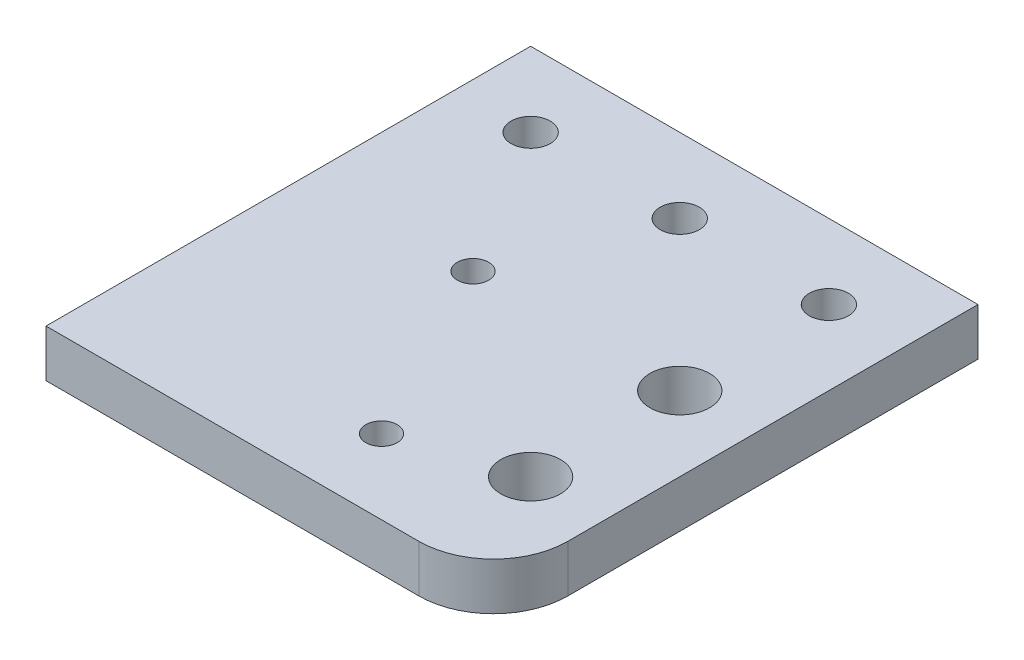
ISO-10303-21;
HEADER;
FILE_DESCRIPTION(('STEP AP214'),'2;1');
FILE_NAME('part.step','',(''),(''),'','','');
FILE_SCHEMA(('AUTOMOTIVE_DESIGN { 1 0 10303 214 1 1 1 1 }'));
ENDSEC;
DATA;
#1=APPLICATION_CONTEXT('core data for automotive mechanical design processes');
#2=APPLICATION_PROTOCOL_DEFINITION('international standard','automotive_design',2000,#1);
#3=PRODUCT_CONTEXT('',#1,'mechanical');
#4=PRODUCT('Part','Part','',(#3));
#5=PRODUCT_RELATED_PRODUCT_CATEGORY('part','',(#4));
#6=PRODUCT_DEFINITION_FORMATION('','',#4);
#7=PRODUCT_DEFINITION_CONTEXT('part definition',#1,'design');
#8=PRODUCT_DEFINITION('design','',#6,#7);
#9=PRODUCT_DEFINITION_SHAPE('','',#8);
#10=(LENGTH_UNIT() NAMED_UNIT(*) SI_UNIT(.MILLI.,.METRE.));
#11=(NAMED_UNIT(*) PLANE_ANGLE_UNIT() SI_UNIT($,.RADIAN.));
#12=(NAMED_UNIT(*) SI_UNIT($,.STERADIAN.) SOLID_ANGLE_UNIT());
#13=UNCERTAINTY_MEASURE_WITH_UNIT(LENGTH_MEASURE(1.E-05),#10,'distance_accuracy_value','');
#14=(GEOMETRIC_REPRESENTATION_CONTEXT(3) GLOBAL_UNCERTAINTY_ASSIGNED_CONTEXT((#13)) GLOBAL_UNIT_ASSIGNED_CONTEXT((#10,
#11,#12)) REPRESENTATION_CONTEXT('',''));
#15=CARTESIAN_POINT('',(0.,0.,0.));
#16=DIRECTION('',(0.,0.,1.));
#17=DIRECTION('',(1.,0.,0.));
#18=AXIS2_PLACEMENT_3D('',#15,#16,#17);
#19=CARTESIAN_POINT('',(0.,6.35,0.));
#20=DIRECTION('',(0.,1.,0.));
#21=DIRECTION('',(0.,0.,1.));
#22=AXIS2_PLACEMENT_3D('',#19,#20,#21);
#23=PLANE('',#22);
#24=CARTESIAN_POINT('',(50.,6.35,50.));
#25=DIRECTION('',(0.,1.,0.));
#26=DIRECTION('',(0.,0.,1.));
#27=AXIS2_PLACEMENT_3D('',#24,#25,#26);
#28=CIRCLE('',#27,4.00000000000001);
#29=CARTESIAN_POINT('',(50.,6.35,54.));
#30=VERTEX_POINT('',#29);
#31=EDGE_CURVE('E155',#30,#30,#28,.T.);
#32=ORIENTED_EDGE('',*,*,#31,.F.);
#33=EDGE_LOOP('',(#32));
#34=FACE_BOUND('',#33,.T.);
#35=CARTESIAN_POINT('',(50.,6.35,30.));
#36=DIRECTION('',(0.,1.,0.));
#37=DIRECTION('',(0.,0.,1.));
#38=AXIS2_PLACEMENT_3D('',#35,#36,#37);
#39=CIRCLE('',#38,4.00000000000001);
#40=CARTESIAN_POINT('',(50.,6.35,34.));
#41=VERTEX_POINT('',#40);
#42=EDGE_CURVE('E149',#41,#41,#39,.T.);
#43=ORIENTED_EDGE('',*,*,#42,.F.);
#44=EDGE_LOOP('',(#43));
#45=FACE_BOUND('',#44,.T.);
#46=CARTESIAN_POINT('',(22.27,6.35,30.));
#47=DIRECTION('',(0.,1.,0.));
#48=DIRECTION('',(0.,0.,1.));
#49=AXIS2_PLACEMENT_3D('',#46,#47,#48);
#50=CIRCLE('',#49,2.1);
#51=CARTESIAN_POINT('',(22.27,6.35,32.1));
#52=VERTEX_POINT('',#51);
#53=EDGE_CURVE('E134',#52,#52,#50,.T.);
#54=ORIENTED_EDGE('',*,*,#53,.F.);
#55=EDGE_LOOP('',(#54));
#56=FACE_BOUND('',#55,.T.);
#57=CARTESIAN_POINT('',(30.,6.35,10.));
#58=DIRECTION('',(0.,1.,0.));
#59=DIRECTION('',(0.,0.,1.));
#60=AXIS2_PLACEMENT_3D('',#57,#58,#59);
#61=CIRCLE('',#60,2.625);
#62=CARTESIAN_POINT('',(30.,6.35,12.625));
#63=VERTEX_POINT('',#62);
#64=EDGE_CURVE('E122',#63,#63,#61,.T.);
#65=ORIENTED_EDGE('',*,*,#64,.F.);
#66=EDGE_LOOP('',(#65));
#67=FACE_BOUND('',#66,.T.);
#68=DIRECTION('',(1.,0.,0.));
#69=VECTOR('',#68,1.);
#70=CARTESIAN_POINT('',(0.,6.35,65.));
#71=LINE('',#70,#69);
#72=CARTESIAN_POINT('',(0.,6.35,65.));
#73=VERTEX_POINT('',#72);
#74=CARTESIAN_POINT('',(50.,6.35,65.));
#75=VERTEX_POINT('',#74);
#76=EDGE_CURVE('E76',#73,#75,#71,.T.);
#77=ORIENTED_EDGE('',*,*,#76,.T.);
#78=CARTESIAN_POINT('',(50.,6.35,55.));
#79=DIRECTION('',(0.,1.,0.));
#80=DIRECTION('',(0.,0.,1.));
#81=AXIS2_PLACEMENT_3D('',#78,#79,#80);
#82=CIRCLE('',#81,10.);
#83=CARTESIAN_POINT('',(60.,6.35,55.));
#84=VERTEX_POINT('',#83);
#85=EDGE_CURVE('E11',#75,#84,#82,.T.);
#86=ORIENTED_EDGE('',*,*,#85,.T.);
#87=DIRECTION('',(0.,0.,-1.));
#88=VECTOR('',#87,1.);
#89=CARTESIAN_POINT('',(60.,6.35,0.));
#90=LINE('',#89,#88);
#91=CARTESIAN_POINT('',(60.,6.35,0.));
#92=VERTEX_POINT('',#91);
#93=EDGE_CURVE('E84',#84,#92,#90,.T.);
#94=ORIENTED_EDGE('',*,*,#93,.T.);
#95=DIRECTION('',(-1.,0.,0.));
#96=VECTOR('',#95,1.);
#97=CARTESIAN_POINT('',(0.,6.35,0.));
#98=LINE('',#97,#96);
#99=CARTESIAN_POINT('',(0.,6.35,0.));
#100=VERTEX_POINT('',#99);
#101=EDGE_CURVE('E90',#92,#100,#98,.T.);
#102=ORIENTED_EDGE('',*,*,#101,.T.);
#103=DIRECTION('',(0.,0.,1.));
#104=VECTOR('',#103,1.);
#105=CARTESIAN_POINT('',(0.,6.35,0.));
#106=LINE('',#105,#104);
#107=EDGE_CURVE('E85',#100,#73,#106,.T.);
#108=ORIENTED_EDGE('',*,*,#107,.T.);
#109=EDGE_LOOP('',(#77,#86,#94,#102,#108));
#110=FACE_BOUND('',#109,.T.);
#111=CARTESIAN_POINT('',(10.,6.35,10.));
#112=DIRECTION('',(0.,1.,0.));
#113=DIRECTION('',(0.,0.,1.));
#114=AXIS2_PLACEMENT_3D('',#111,#112,#113);
#115=CIRCLE('',#114,2.625);
#116=CARTESIAN_POINT('',(10.,6.35,12.625));
#117=VERTEX_POINT('',#116);
#118=EDGE_CURVE('E116',#117,#117,#115,.T.);
#119=ORIENTED_EDGE('',*,*,#118,.F.);
#120=EDGE_LOOP('',(#119));
#121=FACE_BOUND('',#120,.T.);
#122=CARTESIAN_POINT('',(50.,6.35,10.));
#123=DIRECTION('',(0.,1.,0.));
#124=DIRECTION('',(0.,0.,1.));
#125=AXIS2_PLACEMENT_3D('',#122,#123,#124);
#126=CIRCLE('',#125,2.625);
#127=CARTESIAN_POINT('',(50.,6.35,12.625));
#128=VERTEX_POINT('',#127);
#129=EDGE_CURVE('E128',#128,#128,#126,.T.);
#130=ORIENTED_EDGE('',*,*,#129,.F.);
#131=EDGE_LOOP('',(#130));
#132=FACE_BOUND('',#131,.T.);
#133=CARTESIAN_POINT('',(35.,6.35,55.));
#134=DIRECTION('',(0.,1.,0.));
#135=DIRECTION('',(0.,0.,1.));
#136=AXIS2_PLACEMENT_3D('',#133,#134,#135);
#137=CIRCLE('',#136,2.1);
#138=CARTESIAN_POINT('',(35.,6.35,57.1));
#139=VERTEX_POINT('',#138);
#140=EDGE_CURVE('E140',#139,#139,#137,.T.);
#141=ORIENTED_EDGE('',*,*,#140,.F.);
#142=EDGE_LOOP('',(#141));
#143=FACE_BOUND('',#142,.T.);
#144=ADVANCED_FACE('F33',(#34,#45,#56,#67,#110,#121,#132,#143),#23,.T.);
#145=CARTESIAN_POINT('',(0.,0.,0.));
#146=DIRECTION('',(0.,1.,0.));
#147=DIRECTION('',(0.,0.,1.));
#148=AXIS2_PLACEMENT_3D('',#145,#146,#147);
#149=PLANE('',#148);
#150=CARTESIAN_POINT('',(50.,0.,50.));
#151=DIRECTION('',(0.,1.,0.));
#152=DIRECTION('',(0.,0.,1.));
#153=AXIS2_PLACEMENT_3D('',#150,#151,#152);
#154=CIRCLE('',#153,4.00000000000001);
#155=CARTESIAN_POINT('',(50.,0.,54.));
#156=VERTEX_POINT('',#155);
#157=EDGE_CURVE('E152',#156,#156,#154,.T.);
#158=ORIENTED_EDGE('',*,*,#157,.T.);
#159=EDGE_LOOP('',(#158));
#160=FACE_BOUND('',#159,.T.);
#161=CARTESIAN_POINT('',(50.,0.,30.));
#162=DIRECTION('',(0.,1.,0.));
#163=DIRECTION('',(0.,0.,1.));
#164=AXIS2_PLACEMENT_3D('',#161,#162,#163);
#165=CIRCLE('',#164,4.00000000000001);
#166=CARTESIAN_POINT('',(50.,0.,34.));
#167=VERTEX_POINT('',#166);
#168=EDGE_CURVE('E146',#167,#167,#165,.T.);
#169=ORIENTED_EDGE('',*,*,#168,.T.);
#170=EDGE_LOOP('',(#169));
#171=FACE_BOUND('',#170,.T.);
#172=DIRECTION('',(0.,0.,-1.));
#173=VECTOR('',#172,1.);
#174=CARTESIAN_POINT('',(60.,0.,0.));
#175=LINE('',#174,#173);
#176=CARTESIAN_POINT('',(60.,0.,55.));
#177=VERTEX_POINT('',#176);
#178=CARTESIAN_POINT('',(60.,0.,0.));
#179=VERTEX_POINT('',#178);
#180=EDGE_CURVE('E111',#177,#179,#175,.T.);
#181=ORIENTED_EDGE('',*,*,#180,.F.);
#182=CARTESIAN_POINT('',(50.,0.,55.));
#183=DIRECTION('',(0.,1.,0.));
#184=DIRECTION('',(0.,0.,1.));
#185=AXIS2_PLACEMENT_3D('',#182,#183,#184);
#186=CIRCLE('',#185,10.);
#187=CARTESIAN_POINT('',(50.,0.,65.));
#188=VERTEX_POINT('',#187);
#189=EDGE_CURVE('E55',#177,#188,#186,.F.);
#190=ORIENTED_EDGE('',*,*,#189,.T.);
#191=DIRECTION('',(1.,0.,0.));
#192=VECTOR('',#191,1.);
#193=CARTESIAN_POINT('',(0.,0.,65.));
#194=LINE('',#193,#192);
#195=CARTESIAN_POINT('',(0.,0.,65.));
#196=VERTEX_POINT('',#195);
#197=EDGE_CURVE('E113',#196,#188,#194,.T.);
#198=ORIENTED_EDGE('',*,*,#197,.F.);
#199=DIRECTION('',(0.,0.,1.));
#200=VECTOR('',#199,1.);
#201=CARTESIAN_POINT('',(0.,0.,0.));
#202=LINE('',#201,#200);
#203=CARTESIAN_POINT('',(0.,0.,0.));
#204=VERTEX_POINT('',#203);
#205=EDGE_CURVE('E98',#204,#196,#202,.T.);
#206=ORIENTED_EDGE('',*,*,#205,.F.);
#207=DIRECTION('',(-1.,0.,0.));
#208=VECTOR('',#207,1.);
#209=CARTESIAN_POINT('',(0.,0.,0.));
#210=LINE('',#209,#208);
#211=EDGE_CURVE('E94',#179,#204,#210,.T.);
#212=ORIENTED_EDGE('',*,*,#211,.F.);
#213=EDGE_LOOP('',(#181,#190,#198,#206,#212));
#214=FACE_BOUND('',#213,.T.);
#215=CARTESIAN_POINT('',(10.,0.,10.));
#216=DIRECTION('',(0.,1.,0.));
#217=DIRECTION('',(0.,0.,1.));
#218=AXIS2_PLACEMENT_3D('',#215,#216,#217);
#219=CIRCLE('',#218,2.625);
#220=CARTESIAN_POINT('',(10.,0.,12.625));
#221=VERTEX_POINT('',#220);
#222=EDGE_CURVE('E119',#221,#221,#219,.T.);
#223=ORIENTED_EDGE('',*,*,#222,.T.);
#224=EDGE_LOOP('',(#223));
#225=FACE_BOUND('',#224,.T.);
#226=CARTESIAN_POINT('',(30.,0.,10.));
#227=DIRECTION('',(0.,1.,0.));
#228=DIRECTION('',(0.,0.,1.));
#229=AXIS2_PLACEMENT_3D('',#226,#227,#228);
#230=CIRCLE('',#229,2.625);
#231=CARTESIAN_POINT('',(30.,0.,12.625));
#232=VERTEX_POINT('',#231);
#233=EDGE_CURVE('E125',#232,#232,#230,.T.);
#234=ORIENTED_EDGE('',*,*,#233,.T.);
#235=EDGE_LOOP('',(#234));
#236=FACE_BOUND('',#235,.T.);
#237=CARTESIAN_POINT('',(50.,0.,10.));
#238=DIRECTION('',(0.,1.,0.));
#239=DIRECTION('',(0.,0.,1.));
#240=AXIS2_PLACEMENT_3D('',#237,#238,#239);
#241=CIRCLE('',#240,2.625);
#242=CARTESIAN_POINT('',(50.,0.,12.625));
#243=VERTEX_POINT('',#242);
#244=EDGE_CURVE('E131',#243,#243,#241,.T.);
#245=ORIENTED_EDGE('',*,*,#244,.T.);
#246=EDGE_LOOP('',(#245));
#247=FACE_BOUND('',#246,.T.);
#248=CARTESIAN_POINT('',(22.27,0.,30.));
#249=DIRECTION('',(0.,1.,0.));
#250=DIRECTION('',(0.,0.,1.));
#251=AXIS2_PLACEMENT_3D('',#248,#249,#250);
#252=CIRCLE('',#251,2.1);
#253=CARTESIAN_POINT('',(22.27,0.,32.1));
#254=VERTEX_POINT('',#253);
#255=EDGE_CURVE('E137',#254,#254,#252,.T.);
#256=ORIENTED_EDGE('',*,*,#255,.T.);
#257=EDGE_LOOP('',(#256));
#258=FACE_BOUND('',#257,.T.);
#259=CARTESIAN_POINT('',(35.,0.,55.));
#260=DIRECTION('',(0.,1.,0.));
#261=DIRECTION('',(0.,0.,1.));
#262=AXIS2_PLACEMENT_3D('',#259,#260,#261);
#263=CIRCLE('',#262,2.1);
#264=CARTESIAN_POINT('',(35.,0.,57.1));
#265=VERTEX_POINT('',#264);
#266=EDGE_CURVE('E143',#265,#265,#263,.T.);
#267=ORIENTED_EDGE('',*,*,#266,.T.);
#268=EDGE_LOOP('',(#267));
#269=FACE_BOUND('',#268,.T.);
#270=ADVANCED_FACE('F161',(#160,#171,#214,#225,#236,#247,#258,#269),#149,.F.);
#271=CARTESIAN_POINT('',(0.,6.35,0.));
#272=DIRECTION('',(1.,0.,0.));
#273=DIRECTION('',(0.,0.,-1.));
#274=AXIS2_PLACEMENT_3D('',#271,#272,#273);
#275=PLANE('',#274);
#276=ORIENTED_EDGE('',*,*,#205,.T.);
#277=DIRECTION('',(0.,-1.,0.));
#278=VECTOR('',#277,1.);
#279=CARTESIAN_POINT('',(0.,6.35,65.));
#280=LINE('',#279,#278);
#281=EDGE_CURVE('E80',#73,#196,#280,.T.);
#282=ORIENTED_EDGE('',*,*,#281,.F.);
#283=ORIENTED_EDGE('',*,*,#107,.F.);
#284=DIRECTION('',(0.,-1.,0.));
#285=VECTOR('',#284,1.);
#286=CARTESIAN_POINT('',(0.,6.35,0.));
#287=LINE('',#286,#285);
#288=EDGE_CURVE('E105',#100,#204,#287,.T.);
#289=ORIENTED_EDGE('',*,*,#288,.T.);
#290=EDGE_LOOP('',(#276,#282,#283,#289));
#291=FACE_BOUND('',#290,.T.);
#292=ADVANCED_FACE('F96',(#291),#275,.F.);
#293=CARTESIAN_POINT('',(0.,6.35,65.));
#294=DIRECTION('',(0.,0.,-1.));
#295=DIRECTION('',(-1.,0.,0.));
#296=AXIS2_PLACEMENT_3D('',#293,#294,#295);
#297=PLANE('',#296);
#298=ORIENTED_EDGE('',*,*,#197,.T.);
#299=DIRECTION('',(0.,-1.,0.));
#300=VECTOR('',#299,1.);
#301=CARTESIAN_POINT('',(50.,6.35,65.));
#302=LINE('',#301,#300);
#303=EDGE_CURVE('E41',#188,#75,#302,.F.);
#304=ORIENTED_EDGE('',*,*,#303,.T.);
#305=ORIENTED_EDGE('',*,*,#76,.F.);
#306=ORIENTED_EDGE('',*,*,#281,.T.);
#307=EDGE_LOOP('',(#298,#304,#305,#306));
#308=FACE_BOUND('',#307,.T.);
#309=ADVANCED_FACE('F78',(#308),#297,.F.);
#310=CARTESIAN_POINT('',(60.,6.35,0.));
#311=DIRECTION('',(-1.,0.,0.));
#312=DIRECTION('',(0.,0.,1.));
#313=AXIS2_PLACEMENT_3D('',#310,#311,#312);
#314=PLANE('',#313);
#315=ORIENTED_EDGE('',*,*,#93,.F.);
#316=DIRECTION('',(0.,-1.,0.));
#317=VECTOR('',#316,1.);
#318=CARTESIAN_POINT('',(60.,6.35,55.));
#319=LINE('',#318,#317);
#320=EDGE_CURVE('E99',#84,#177,#319,.T.);
#321=ORIENTED_EDGE('',*,*,#320,.T.);
#322=ORIENTED_EDGE('',*,*,#180,.T.);
#323=DIRECTION('',(0.,-1.,0.));
#324=VECTOR('',#323,1.);
#325=CARTESIAN_POINT('',(60.,6.35,0.));
#326=LINE('',#325,#324);
#327=EDGE_CURVE('E100',#92,#179,#326,.T.);
#328=ORIENTED_EDGE('',*,*,#327,.F.);
#329=EDGE_LOOP('',(#315,#321,#322,#328));
#330=FACE_BOUND('',#329,.T.);
#331=ADVANCED_FACE('F220',(#330),#314,.F.);
#332=CARTESIAN_POINT('',(0.,6.35,0.));
#333=DIRECTION('',(0.,0.,1.));
#334=DIRECTION('',(1.,0.,0.));
#335=AXIS2_PLACEMENT_3D('',#332,#333,#334);
#336=PLANE('',#335);
#337=ORIENTED_EDGE('',*,*,#211,.T.);
#338=ORIENTED_EDGE('',*,*,#288,.F.);
#339=ORIENTED_EDGE('',*,*,#101,.F.);
#340=ORIENTED_EDGE('',*,*,#327,.T.);
#341=EDGE_LOOP('',(#337,#338,#339,#340));
#342=FACE_BOUND('',#341,.T.);
#343=ADVANCED_FACE('F215',(#342),#336,.F.);
#344=CARTESIAN_POINT('',(10.,6.35,10.));
#345=DIRECTION('',(0.,-1.,0.));
#346=DIRECTION('',(0.,0.,-1.));
#347=AXIS2_PLACEMENT_3D('',#344,#345,#346);
#348=CYLINDRICAL_SURFACE('',#347,2.625);
#349=ORIENTED_EDGE('',*,*,#118,.T.);
#350=EDGE_LOOP('',(#349));
#351=FACE_BOUND('',#350,.T.);
#352=ORIENTED_EDGE('',*,*,#222,.F.);
#353=EDGE_LOOP('',(#352));
#354=FACE_BOUND('',#353,.T.);
#355=ADVANCED_FACE('F184',(#351,#354),#348,.F.);
#356=CARTESIAN_POINT('',(30.,6.35,10.));
#357=DIRECTION('',(0.,-1.,0.));
#358=DIRECTION('',(0.,0.,-1.));
#359=AXIS2_PLACEMENT_3D('',#356,#357,#358);
#360=CYLINDRICAL_SURFACE('',#359,2.625);
#361=ORIENTED_EDGE('',*,*,#64,.T.);
#362=EDGE_LOOP('',(#361));
#363=FACE_BOUND('',#362,.T.);
#364=ORIENTED_EDGE('',*,*,#233,.F.);
#365=EDGE_LOOP('',(#364));
#366=FACE_BOUND('',#365,.T.);
#367=ADVANCED_FACE('F180',(#363,#366),#360,.F.);
#368=CARTESIAN_POINT('',(50.,6.35,10.));
#369=DIRECTION('',(0.,-1.,0.));
#370=DIRECTION('',(0.,0.,-1.));
#371=AXIS2_PLACEMENT_3D('',#368,#369,#370);
#372=CYLINDRICAL_SURFACE('',#371,2.625);
#373=ORIENTED_EDGE('',*,*,#129,.T.);
#374=EDGE_LOOP('',(#373));
#375=FACE_BOUND('',#374,.T.);
#376=ORIENTED_EDGE('',*,*,#244,.F.);
#377=EDGE_LOOP('',(#376));
#378=FACE_BOUND('',#377,.T.);
#379=ADVANCED_FACE('F183',(#375,#378),#372,.F.);
#380=CARTESIAN_POINT('',(22.27,6.35,30.));
#381=DIRECTION('',(0.,-1.,0.));
#382=DIRECTION('',(0.,0.,-1.));
#383=AXIS2_PLACEMENT_3D('',#380,#381,#382);
#384=CYLINDRICAL_SURFACE('',#383,2.1);
#385=ORIENTED_EDGE('',*,*,#53,.T.);
#386=EDGE_LOOP('',(#385));
#387=FACE_BOUND('',#386,.T.);
#388=ORIENTED_EDGE('',*,*,#255,.F.);
#389=EDGE_LOOP('',(#388));
#390=FACE_BOUND('',#389,.T.);
#391=ADVANCED_FACE('F199',(#387,#390),#384,.F.);
#392=CARTESIAN_POINT('',(35.,6.35,55.));
#393=DIRECTION('',(0.,-1.,0.));
#394=DIRECTION('',(0.,0.,-1.));
#395=AXIS2_PLACEMENT_3D('',#392,#393,#394);
#396=CYLINDRICAL_SURFACE('',#395,2.1);
#397=ORIENTED_EDGE('',*,*,#140,.T.);
#398=EDGE_LOOP('',(#397));
#399=FACE_BOUND('',#398,.T.);
#400=ORIENTED_EDGE('',*,*,#266,.F.);
#401=EDGE_LOOP('',(#400));
#402=FACE_BOUND('',#401,.T.);
#403=ADVANCED_FACE('F197',(#399,#402),#396,.F.);
#404=CARTESIAN_POINT('',(50.,6.35,55.));
#405=DIRECTION('',(0.,-1.,0.));
#406=DIRECTION('',(0.,0.,-1.));
#407=AXIS2_PLACEMENT_3D('',#404,#405,#406);
#408=CYLINDRICAL_SURFACE('',#407,10.);
#409=ORIENTED_EDGE('',*,*,#85,.F.);
#410=ORIENTED_EDGE('',*,*,#303,.F.);
#411=ORIENTED_EDGE('',*,*,#189,.F.);
#412=ORIENTED_EDGE('',*,*,#320,.F.);
#413=EDGE_LOOP('',(#409,#410,#411,#412));
#414=FACE_BOUND('',#413,.T.);
#415=ADVANCED_FACE('F35',(#414),#408,.T.);
#416=CARTESIAN_POINT('',(50.,0.,30.));
#417=DIRECTION('',(0.,1.,0.));
#418=DIRECTION('',(0.,0.,1.));
#419=AXIS2_PLACEMENT_3D('',#416,#417,#418);
#420=CYLINDRICAL_SURFACE('',#419,4.00000000000001);
#421=ORIENTED_EDGE('',*,*,#168,.F.);
#422=EDGE_LOOP('',(#421));
#423=FACE_BOUND('',#422,.T.);
#424=ORIENTED_EDGE('',*,*,#42,.T.);
#425=EDGE_LOOP('',(#424));
#426=FACE_BOUND('',#425,.T.);
#427=ADVANCED_FACE('F167',(#423,#426),#420,.F.);
#428=CARTESIAN_POINT('',(50.,0.,50.));
#429=DIRECTION('',(0.,1.,0.));
#430=DIRECTION('',(0.,0.,1.));
#431=AXIS2_PLACEMENT_3D('',#428,#429,#430);
#432=CYLINDRICAL_SURFACE('',#431,4.00000000000001);
#433=ORIENTED_EDGE('',*,*,#157,.F.);
#434=EDGE_LOOP('',(#433));
#435=FACE_BOUND('',#434,.T.);
#436=ORIENTED_EDGE('',*,*,#31,.T.);
#437=EDGE_LOOP('',(#436));
#438=FACE_BOUND('',#437,.T.);
#439=ADVANCED_FACE('F164',(#435,#438),#432,.F.);
#440=CLOSED_SHELL('',(#144,#270,#292,#309,#331,#343,#355,#367,#379,#391,#403,#415,#427,#439));
#441=MANIFOLD_SOLID_BREP('B2',#440);
#442=ADVANCED_BREP_SHAPE_REPRESENTATION('',(#18,#441),#14);
#443=SHAPE_DEFINITION_REPRESENTATION(#9,#442);
ENDSEC;
END-ISO-10303-21;
